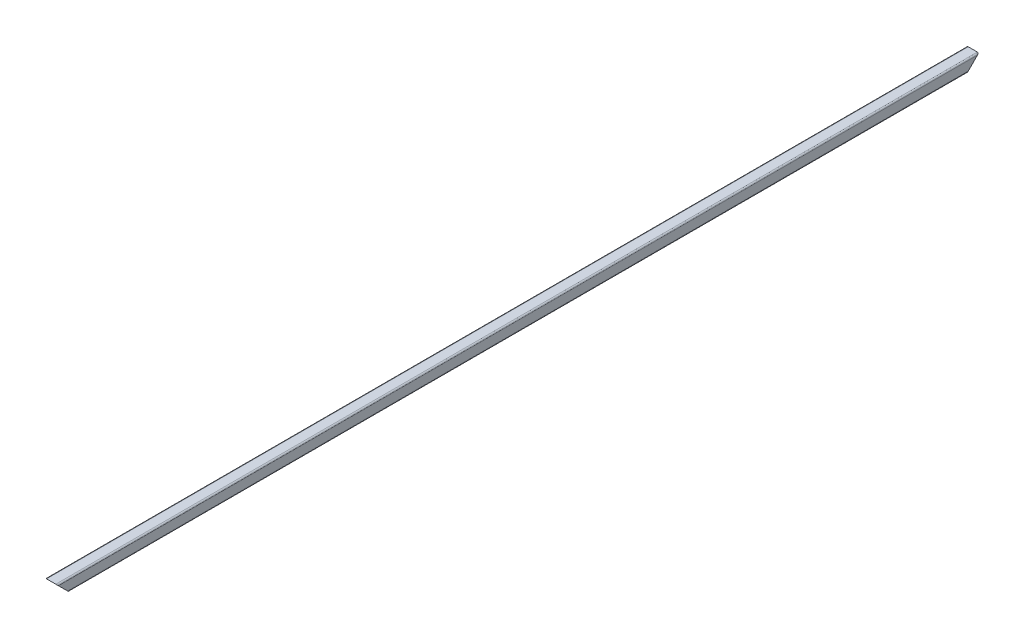
ISO-10303-21;
HEADER;
FILE_DESCRIPTION(('STEP AP214'),'2;1');
FILE_NAME('part.step','',(''),(''),'','','');
FILE_SCHEMA(('AUTOMOTIVE_DESIGN { 1 0 10303 214 1 1 1 1 }'));
ENDSEC;
DATA;
#1=APPLICATION_CONTEXT('core data for automotive mechanical design processes');
#2=APPLICATION_PROTOCOL_DEFINITION('international standard','automotive_design',2000,#1);
#3=PRODUCT_CONTEXT('',#1,'mechanical');
#4=PRODUCT('Part','Part','',(#3));
#5=PRODUCT_RELATED_PRODUCT_CATEGORY('part','',(#4));
#6=PRODUCT_DEFINITION_FORMATION('','',#4);
#7=PRODUCT_DEFINITION_CONTEXT('part definition',#1,'design');
#8=PRODUCT_DEFINITION('design','',#6,#7);
#9=PRODUCT_DEFINITION_SHAPE('','',#8);
#10=(LENGTH_UNIT() NAMED_UNIT(*) SI_UNIT(.MILLI.,.METRE.));
#11=(NAMED_UNIT(*) PLANE_ANGLE_UNIT() SI_UNIT($,.RADIAN.));
#12=(NAMED_UNIT(*) SI_UNIT($,.STERADIAN.) SOLID_ANGLE_UNIT());
#13=UNCERTAINTY_MEASURE_WITH_UNIT(LENGTH_MEASURE(1.E-05),#10,'distance_accuracy_value','');
#14=(GEOMETRIC_REPRESENTATION_CONTEXT(3) GLOBAL_UNCERTAINTY_ASSIGNED_CONTEXT((#13)) GLOBAL_UNIT_ASSIGNED_CONTEXT((#10,
#11,#12)) REPRESENTATION_CONTEXT('',''));
#15=CARTESIAN_POINT('',(0.,0.,0.));
#16=DIRECTION('',(0.,0.,1.));
#17=DIRECTION('',(1.,0.,0.));
#18=AXIS2_PLACEMENT_3D('',#15,#16,#17);
#19=CARTESIAN_POINT('',(-15.5000000000105,1940.,-3059.99999999996));
#20=DIRECTION('',(0.,1.,0.));
#21=DIRECTION('',(0.,0.,0.99999999999999));
#22=AXIS2_PLACEMENT_3D('',#19,#20,#21);
#23=PLANE('',#22);
#24=DIRECTION('',(1.,0.,0.));
#25=VECTOR('',#24,1.);
#26=CARTESIAN_POINT('',(-15.5000000000106,1940.00000000001,-19.9999999999911));
#27=LINE('',#26,#25);
#28=CARTESIAN_POINT('',(-15.5000000000106,1940.00000000001,-19.9999999999902));
#29=VERTEX_POINT('',#28);
#30=CARTESIAN_POINT('',(15.4999999999891,1940.,-19.9999999999929));
#31=VERTEX_POINT('',#30);
#32=EDGE_CURVE('E267',#29,#31,#27,.T.);
#33=ORIENTED_EDGE('',*,*,#32,.F.);
#34=DIRECTION('',(0.,0.,0.99999999999999));
#35=VECTOR('',#34,1.);
#36=CARTESIAN_POINT('',(-15.5000000000105,1940.,-3059.99999999996));
#37=LINE('',#36,#35);
#38=CARTESIAN_POINT('',(-15.5000000000057,1940.,-3039.99999999996));
#39=VERTEX_POINT('',#38);
#40=EDGE_CURVE('E231',#39,#29,#37,.T.);
#41=ORIENTED_EDGE('',*,*,#40,.F.);
#42=DIRECTION('',(-1.,0.,0.));
#43=VECTOR('',#42,1.);
#44=CARTESIAN_POINT('',(-15.5000000000057,1940.,-3039.99999999996));
#45=LINE('',#44,#43);
#46=CARTESIAN_POINT('',(15.4999999999945,1939.99999999999,-3039.99999999996));
#47=VERTEX_POINT('',#46);
#48=EDGE_CURVE('E331',#47,#39,#45,.T.);
#49=ORIENTED_EDGE('',*,*,#48,.F.);
#50=DIRECTION('',(0.,0.,0.99999999999999));
#51=VECTOR('',#50,1.);
#52=CARTESIAN_POINT('',(15.4999999999892,1940.,-3059.99999999996));
#53=LINE('',#52,#51);
#54=EDGE_CURVE('E234',#47,#31,#53,.T.);
#55=ORIENTED_EDGE('',*,*,#54,.T.);
#56=EDGE_LOOP('',(#33,#41,#49,#55));
#57=FACE_BOUND('',#56,.T.);
#58=ADVANCED_FACE('F45',(#57),#23,.F.);
#59=CARTESIAN_POINT('',(-20.0000000000107,1944.5,-3059.99999999996));
#60=DIRECTION('',(1.,0.,0.));
#61=DIRECTION('',(0.,0.,-0.99999999999999));
#62=AXIS2_PLACEMENT_3D('',#59,#60,#61);
#63=PLANE('',#62);
#64=DIRECTION('',(0.,-0.707106781186548,-0.707106781186537));
#65=VECTOR('',#64,1.);
#66=CARTESIAN_POINT('',(-20.0000000000107,422.25,-1537.74999999998));
#67=LINE('',#66,#65);
#68=CARTESIAN_POINT('',(-20.00000000001,1975.5,15.4999999999998));
#69=VERTEX_POINT('',#68);
#70=CARTESIAN_POINT('',(-20.0000000000053,1944.5,-15.4999999999959));
#71=VERTEX_POINT('',#70);
#72=EDGE_CURVE('E284',#69,#71,#67,.T.);
#73=ORIENTED_EDGE('',*,*,#72,.F.);
#74=DIRECTION('',(0.,0.,0.99999999999999));
#75=VECTOR('',#74,1.);
#76=CARTESIAN_POINT('',(-20.0000000000159,1975.5,-3059.99999999996));
#77=LINE('',#76,#75);
#78=CARTESIAN_POINT('',(-20.00000000001,1975.49999999999,-3075.49999999996));
#79=VERTEX_POINT('',#78);
#80=EDGE_CURVE('E203',#79,#69,#77,.T.);
#81=ORIENTED_EDGE('',*,*,#80,.F.);
#82=DIRECTION('',(0.,0.707106781186548,-0.707106781186537));
#83=VECTOR('',#82,1.);
#84=CARTESIAN_POINT('',(-20.0000000000052,1952.25,-3052.24999999996));
#85=LINE('',#84,#83);
#86=CARTESIAN_POINT('',(-20.0000000000107,1944.5,-3044.49999999996));
#87=VERTEX_POINT('',#86);
#88=EDGE_CURVE('E354',#87,#79,#85,.T.);
#89=ORIENTED_EDGE('',*,*,#88,.F.);
#90=DIRECTION('',(0.,0.,0.99999999999999));
#91=VECTOR('',#90,1.);
#92=CARTESIAN_POINT('',(-20.0000000000107,1944.5,-3059.99999999996));
#93=LINE('',#92,#91);
#94=EDGE_CURVE('E64',#87,#71,#93,.T.);
#95=ORIENTED_EDGE('',*,*,#94,.T.);
#96=EDGE_LOOP('',(#73,#81,#89,#95));
#97=FACE_BOUND('',#96,.T.);
#98=ADVANCED_FACE('F366',(#97),#63,.F.);
#99=CARTESIAN_POINT('',(-15.5000000000158,1975.5,-3059.99999999996));
#100=DIRECTION('',(0.,0.,0.99999999999999));
#101=DIRECTION('',(1.,0.,0.));
#102=AXIS2_PLACEMENT_3D('',#99,#100,#101);
#103=CYLINDRICAL_SURFACE('',#102,4.5);
#104=CARTESIAN_POINT('',(-15.5000000000105,1975.50000000001,15.5000000000021));
#105=DIRECTION('',(0.,-0.707106781186547,0.707106781186538));
#106=DIRECTION('',(0.,0.707106781186548,0.707106781186537));
#107=AXIS2_PLACEMENT_3D('',#104,#105,#106);
#108=ELLIPSE('',#107,6.36396103067893,4.5);
#109=CARTESIAN_POINT('',(-15.5000000000105,1980.,20.0000000000058));
#110=VERTEX_POINT('',#109);
#111=EDGE_CURVE('E288',#110,#69,#108,.T.);
#112=ORIENTED_EDGE('',*,*,#111,.F.);
#113=DIRECTION('',(0.,0.,0.99999999999999));
#114=VECTOR('',#113,1.);
#115=CARTESIAN_POINT('',(-15.5000000000105,1980.,-3059.99999999996));
#116=LINE('',#115,#114);
#117=CARTESIAN_POINT('',(-15.5000000000052,1980.00000000001,-3079.99999999996));
#118=VERTEX_POINT('',#117);
#119=EDGE_CURVE('E249',#118,#110,#116,.T.);
#120=ORIENTED_EDGE('',*,*,#119,.F.);
#121=CARTESIAN_POINT('',(-15.5000000000106,1975.5,-3075.49999999996));
#122=DIRECTION('',(0.,-0.707106781186547,-0.707106781186538));
#123=DIRECTION('',(0.,-0.707106781186548,0.707106781186537));
#124=AXIS2_PLACEMENT_3D('',#121,#122,#123);
#125=ELLIPSE('',#124,6.36396103067893,4.5);
#126=EDGE_CURVE('E351',#79,#118,#125,.T.);
#127=ORIENTED_EDGE('',*,*,#126,.F.);
#128=ORIENTED_EDGE('',*,*,#80,.T.);
#129=EDGE_LOOP('',(#112,#120,#127,#128));
#130=FACE_BOUND('',#129,.T.);
#131=ADVANCED_FACE('F368',(#130),#103,.T.);
#132=CARTESIAN_POINT('',(-15.5000000000105,1980.,-3059.99999999996));
#133=DIRECTION('',(0.,-1.,0.));
#134=DIRECTION('',(0.,0.,-0.99999999999999));
#135=AXIS2_PLACEMENT_3D('',#132,#133,#134);
#136=PLANE('',#135);
#137=DIRECTION('',(-1.,0.,0.));
#138=VECTOR('',#137,1.);
#139=CARTESIAN_POINT('',(-15.5000000000105,1980.,20.0000000000067));
#140=LINE('',#139,#138);
#141=CARTESIAN_POINT('',(15.4999999999892,1979.99999999999,19.9999999999974));
#142=VERTEX_POINT('',#141);
#143=EDGE_CURVE('E292',#142,#110,#140,.T.);
#144=ORIENTED_EDGE('',*,*,#143,.F.);
#145=DIRECTION('',(0.,0.,0.99999999999999));
#146=VECTOR('',#145,1.);
#147=CARTESIAN_POINT('',(15.4999999999896,1980.,-3059.99999999996));
#148=LINE('',#147,#146);
#149=CARTESIAN_POINT('',(15.4999999999945,1980.,-3079.99999999996));
#150=VERTEX_POINT('',#149);
#151=EDGE_CURVE('E245',#150,#142,#148,.T.);
#152=ORIENTED_EDGE('',*,*,#151,.F.);
#153=DIRECTION('',(1.,0.,0.));
#154=VECTOR('',#153,1.);
#155=CARTESIAN_POINT('',(-15.5000000000052,1980.00000000001,-3079.99999999996));
#156=LINE('',#155,#154);
#157=EDGE_CURVE('E347',#118,#150,#156,.T.);
#158=ORIENTED_EDGE('',*,*,#157,.F.);
#159=ORIENTED_EDGE('',*,*,#119,.T.);
#160=EDGE_LOOP('',(#144,#152,#158,#159));
#161=FACE_BOUND('',#160,.T.);
#162=ADVANCED_FACE('F372',(#161),#136,.F.);
#163=CARTESIAN_POINT('',(15.4999999999843,1975.5,-3059.99999999996));
#164=DIRECTION('',(0.,0.,0.99999999999999));
#165=DIRECTION('',(1.,0.,0.));
#166=AXIS2_PLACEMENT_3D('',#163,#164,#165);
#167=CYLINDRICAL_SURFACE('',#166,4.5);
#168=CARTESIAN_POINT('',(15.4999999999896,1975.5,15.5000000000061));
#169=DIRECTION('',(0.,-0.707106781186547,0.707106781186538));
#170=DIRECTION('',(0.,0.707106781186548,0.707106781186537));
#171=AXIS2_PLACEMENT_3D('',#168,#169,#170);
#172=ELLIPSE('',#171,6.36396103067893,4.5);
#173=CARTESIAN_POINT('',(19.9999999999896,1975.50000000001,15.5000000000061));
#174=VERTEX_POINT('',#173);
#175=EDGE_CURVE('E296',#174,#142,#172,.T.);
#176=ORIENTED_EDGE('',*,*,#175,.F.);
#177=DIRECTION('',(0.,0.,0.99999999999999));
#178=VECTOR('',#177,1.);
#179=CARTESIAN_POINT('',(19.9999999999841,1975.5,-3059.99999999996));
#180=LINE('',#179,#178);
#181=CARTESIAN_POINT('',(19.9999999999896,1975.5,-3075.49999999996));
#182=VERTEX_POINT('',#181);
#183=EDGE_CURVE('E241',#182,#174,#180,.T.);
#184=ORIENTED_EDGE('',*,*,#183,.F.);
#185=CARTESIAN_POINT('',(15.4999999999896,1975.49999999999,-3075.49999999996));
#186=DIRECTION('',(0.,-0.707106781186547,-0.707106781186538));
#187=DIRECTION('',(0.,-0.707106781186548,0.707106781186537));
#188=AXIS2_PLACEMENT_3D('',#185,#186,#187);
#189=ELLIPSE('',#188,6.36396103067893,4.5);
#190=EDGE_CURVE('E343',#150,#182,#189,.T.);
#191=ORIENTED_EDGE('',*,*,#190,.F.);
#192=ORIENTED_EDGE('',*,*,#151,.T.);
#193=EDGE_LOOP('',(#176,#184,#191,#192));
#194=FACE_BOUND('',#193,.T.);
#195=ADVANCED_FACE('F374',(#194),#167,.T.);
#196=CARTESIAN_POINT('',(19.9999999999894,1944.5,-3059.99999999996));
#197=DIRECTION('',(-1.,0.,0.));
#198=DIRECTION('',(0.,0.,0.99999999999999));
#199=AXIS2_PLACEMENT_3D('',#196,#197,#198);
#200=PLANE('',#199);
#201=DIRECTION('',(0.,0.707106781186548,0.707106781186537));
#202=VECTOR('',#201,1.);
#203=CARTESIAN_POINT('',(19.9999999999894,422.250000000006,-1537.74999999997));
#204=LINE('',#203,#202);
#205=CARTESIAN_POINT('',(19.9999999999947,1944.5,-15.5000000000001));
#206=VERTEX_POINT('',#205);
#207=EDGE_CURVE('E300',#206,#174,#204,.T.);
#208=ORIENTED_EDGE('',*,*,#207,.F.);
#209=DIRECTION('',(0.,0.,0.99999999999999));
#210=VECTOR('',#209,1.);
#211=CARTESIAN_POINT('',(19.9999999999894,1944.5,-3059.99999999996));
#212=LINE('',#211,#210);
#213=CARTESIAN_POINT('',(19.9999999999894,1944.5,-3044.49999999996));
#214=VERTEX_POINT('',#213);
#215=EDGE_CURVE('E237',#214,#206,#212,.T.);
#216=ORIENTED_EDGE('',*,*,#215,.F.);
#217=DIRECTION('',(0.,-0.707106781186548,0.707106781186537));
#218=VECTOR('',#217,1.);
#219=CARTESIAN_POINT('',(19.9999999999948,1952.25,-3052.24999999996));
#220=LINE('',#219,#218);
#221=EDGE_CURVE('E339',#182,#214,#220,.T.);
#222=ORIENTED_EDGE('',*,*,#221,.F.);
#223=ORIENTED_EDGE('',*,*,#183,.T.);
#224=EDGE_LOOP('',(#208,#216,#222,#223));
#225=FACE_BOUND('',#224,.T.);
#226=ADVANCED_FACE('F379',(#225),#200,.F.);
#227=CARTESIAN_POINT('',(15.4999999999896,1944.5,-3059.99999999996));
#228=DIRECTION('',(0.,0.,0.99999999999999));
#229=DIRECTION('',(1.,0.,0.));
#230=AXIS2_PLACEMENT_3D('',#227,#228,#229);
#231=CYLINDRICAL_SURFACE('',#230,4.5);
#232=CARTESIAN_POINT('',(15.4999999999949,1944.5,-15.5000000000025));
#233=DIRECTION('',(0.,-0.707106781186547,0.707106781186538));
#234=DIRECTION('',(0.,0.707106781186548,0.707106781186537));
#235=AXIS2_PLACEMENT_3D('',#232,#233,#234);
#236=ELLIPSE('',#235,6.36396103067893,4.5);
#237=EDGE_CURVE('E304',#31,#206,#236,.T.);
#238=ORIENTED_EDGE('',*,*,#237,.F.);
#239=ORIENTED_EDGE('',*,*,#54,.F.);
#240=CARTESIAN_POINT('',(15.4999999999891,1944.5,-3044.49999999996));
#241=DIRECTION('',(0.,-0.707106781186547,-0.707106781186538));
#242=DIRECTION('',(0.,-0.707106781186548,0.707106781186537));
#243=AXIS2_PLACEMENT_3D('',#240,#241,#242);
#244=ELLIPSE('',#243,6.36396103067893,4.5);
#245=EDGE_CURVE('E335',#214,#47,#244,.T.);
#246=ORIENTED_EDGE('',*,*,#245,.F.);
#247=ORIENTED_EDGE('',*,*,#215,.T.);
#248=EDGE_LOOP('',(#238,#239,#246,#247));
#249=FACE_BOUND('',#248,.T.);
#250=ADVANCED_FACE('F381',(#249),#231,.T.);
#251=CARTESIAN_POINT('',(-15.5000000000105,1944.5,-3059.99999999996));
#252=DIRECTION('',(0.,0.,0.99999999999999));
#253=DIRECTION('',(1.,0.,0.));
#254=AXIS2_PLACEMENT_3D('',#251,#252,#253);
#255=CYLINDRICAL_SURFACE('',#254,4.5);
#256=CARTESIAN_POINT('',(-15.5000000000052,1944.5,-15.4999999999932));
#257=DIRECTION('',(0.,-0.707106781186547,0.707106781186538));
#258=DIRECTION('',(0.,0.707106781186548,0.707106781186537));
#259=AXIS2_PLACEMENT_3D('',#256,#257,#258);
#260=ELLIPSE('',#259,6.36396103067893,4.5);
#261=EDGE_CURVE('E189',#71,#29,#260,.T.);
#262=ORIENTED_EDGE('',*,*,#261,.F.);
#263=ORIENTED_EDGE('',*,*,#94,.F.);
#264=CARTESIAN_POINT('',(-15.5000000000106,1944.5,-3044.49999999996));
#265=DIRECTION('',(0.,-0.707106781186547,-0.707106781186538));
#266=DIRECTION('',(0.,-0.707106781186548,0.707106781186537));
#267=AXIS2_PLACEMENT_3D('',#264,#265,#266);
#268=ELLIPSE('',#267,6.36396103067893,4.5);
#269=EDGE_CURVE('E206',#39,#87,#268,.T.);
#270=ORIENTED_EDGE('',*,*,#269,.F.);
#271=ORIENTED_EDGE('',*,*,#40,.T.);
#272=EDGE_LOOP('',(#262,#263,#270,#271));
#273=FACE_BOUND('',#272,.T.);
#274=ADVANCED_FACE('F47',(#273),#255,.T.);
#275=CARTESIAN_POINT('',(-15.0000000000107,1945.,-3059.99999999996));
#276=DIRECTION('',(0.,0.,0.99999999999999));
#277=DIRECTION('',(1.,0.,0.));
#278=AXIS2_PLACEMENT_3D('',#275,#276,#277);
#279=CYLINDRICAL_SURFACE('',#278,3.);
#280=DIRECTION('',(0.,0.,0.99999999999999));
#281=VECTOR('',#280,1.);
#282=CARTESIAN_POINT('',(-18.0000000000105,1945.,-3059.99999999996));
#283=LINE('',#282,#281);
#284=CARTESIAN_POINT('',(-18.0000000000103,1945.,-3044.99999999996));
#285=VERTEX_POINT('',#284);
#286=CARTESIAN_POINT('',(-18.0000000000006,1944.99999999999,-15.0000000000021));
#287=VERTEX_POINT('',#286);
#288=EDGE_CURVE('E184',#285,#287,#283,.T.);
#289=ORIENTED_EDGE('',*,*,#288,.T.);
#290=CARTESIAN_POINT('',(-15.0000000000001,1945.,-14.999999999997));
#291=DIRECTION('',(0.,-0.707106781186547,0.707106781186538));
#292=DIRECTION('',(0.,0.707106781186548,0.707106781186537));
#293=AXIS2_PLACEMENT_3D('',#290,#291,#292);
#294=ELLIPSE('',#293,4.24264068711928,3.);
#295=CARTESIAN_POINT('',(-15.0000000000001,1942.,-17.9999999999976));
#296=VERTEX_POINT('',#295);
#297=EDGE_CURVE('E11',#287,#296,#294,.T.);
#298=ORIENTED_EDGE('',*,*,#297,.T.);
#299=DIRECTION('',(0.,0.,0.99999999999999));
#300=VECTOR('',#299,1.);
#301=CARTESIAN_POINT('',(-15.0000000000108,1942.,-3059.99999999996));
#302=LINE('',#301,#300);
#303=CARTESIAN_POINT('',(-15.0000000000108,1942.00000000001,-3041.99999999996));
#304=VERTEX_POINT('',#303);
#305=EDGE_CURVE('E228',#304,#296,#302,.T.);
#306=ORIENTED_EDGE('',*,*,#305,.F.);
#307=CARTESIAN_POINT('',(-15.0000000000107,1945.00000000001,-3044.99999999996));
#308=DIRECTION('',(0.,-0.707106781186547,-0.707106781186538));
#309=DIRECTION('',(0.,-0.707106781186548,0.707106781186537));
#310=AXIS2_PLACEMENT_3D('',#307,#308,#309);
#311=ELLIPSE('',#310,4.24264068711928,3.);
#312=EDGE_CURVE('E194',#304,#285,#311,.T.);
#313=ORIENTED_EDGE('',*,*,#312,.T.);
#314=EDGE_LOOP('',(#289,#298,#306,#313));
#315=FACE_BOUND('',#314,.T.);
#316=ADVANCED_FACE('F193',(#315),#279,.F.);
#317=CARTESIAN_POINT('',(-15.0000000000108,1942.,-3059.99999999996));
#318=DIRECTION('',(0.,1.,0.));
#319=DIRECTION('',(0.,0.,0.99999999999999));
#320=AXIS2_PLACEMENT_3D('',#317,#318,#319);
#321=PLANE('',#320);
#322=ORIENTED_EDGE('',*,*,#305,.T.);
#323=DIRECTION('',(1.,0.,0.));
#324=VECTOR('',#323,1.);
#325=CARTESIAN_POINT('',(-15.0000000000001,1942.,-17.9999999999976));
#326=LINE('',#325,#324);
#327=CARTESIAN_POINT('',(14.9999999999997,1941.99999999999,-18.0000000000027));
#328=VERTEX_POINT('',#327);
#329=EDGE_CURVE('E73',#296,#328,#326,.T.);
#330=ORIENTED_EDGE('',*,*,#329,.T.);
#331=DIRECTION('',(0.,0.,0.99999999999999));
#332=VECTOR('',#331,1.);
#333=CARTESIAN_POINT('',(14.9999999999895,1942.,-3059.99999999996));
#334=LINE('',#333,#332);
#335=CARTESIAN_POINT('',(14.9999999999895,1942.,-3041.99999999996));
#336=VERTEX_POINT('',#335);
#337=EDGE_CURVE('E224',#336,#328,#334,.T.);
#338=ORIENTED_EDGE('',*,*,#337,.F.);
#339=DIRECTION('',(-1.,0.,0.));
#340=VECTOR('',#339,1.);
#341=CARTESIAN_POINT('',(-15.0000000000108,1942.00000000001,-3041.99999999996));
#342=LINE('',#341,#340);
#343=EDGE_CURVE('E325',#336,#304,#342,.T.);
#344=ORIENTED_EDGE('',*,*,#343,.T.);
#345=EDGE_LOOP('',(#322,#330,#338,#344));
#346=FACE_BOUND('',#345,.T.);
#347=ADVANCED_FACE('F418',(#346),#321,.T.);
#348=CARTESIAN_POINT('',(14.9999999999895,1945.,-3059.99999999996));
#349=DIRECTION('',(0.,0.,0.99999999999999));
#350=DIRECTION('',(1.,0.,0.));
#351=AXIS2_PLACEMENT_3D('',#348,#349,#350);
#352=CYLINDRICAL_SURFACE('',#351,3.);
#353=ORIENTED_EDGE('',*,*,#337,.T.);
#354=CARTESIAN_POINT('',(14.9999999999997,1944.99999999999,-15.0000000000023));
#355=DIRECTION('',(0.,-0.707106781186547,0.707106781186538));
#356=DIRECTION('',(0.,0.707106781186548,0.707106781186537));
#357=AXIS2_PLACEMENT_3D('',#354,#355,#356);
#358=ELLIPSE('',#357,4.24264068711928,3.);
#359=CARTESIAN_POINT('',(17.9999999999999,1945.,-14.999999999997));
#360=VERTEX_POINT('',#359);
#361=EDGE_CURVE('E503',#328,#360,#358,.T.);
#362=ORIENTED_EDGE('',*,*,#361,.T.);
#363=DIRECTION('',(0.,0.,0.99999999999999));
#364=VECTOR('',#363,1.);
#365=CARTESIAN_POINT('',(17.9999999999896,1945.,-3059.99999999996));
#366=LINE('',#365,#364);
#367=CARTESIAN_POINT('',(17.9999999999892,1945.00000000001,-3044.99999999996));
#368=VERTEX_POINT('',#367);
#369=EDGE_CURVE('E220',#368,#360,#366,.T.);
#370=ORIENTED_EDGE('',*,*,#369,.F.);
#371=CARTESIAN_POINT('',(14.9999999999895,1945.,-3044.99999999996));
#372=DIRECTION('',(0.,-0.707106781186547,-0.707106781186538));
#373=DIRECTION('',(0.,-0.707106781186548,0.707106781186537));
#374=AXIS2_PLACEMENT_3D('',#371,#372,#373);
#375=ELLIPSE('',#374,4.24264068711928,3.);
#376=EDGE_CURVE('E321',#368,#336,#375,.T.);
#377=ORIENTED_EDGE('',*,*,#376,.T.);
#378=EDGE_LOOP('',(#353,#362,#370,#377));
#379=FACE_BOUND('',#378,.T.);
#380=ADVANCED_FACE('F414',(#379),#352,.F.);
#381=CARTESIAN_POINT('',(17.9999999999896,1945.,-3059.99999999996));
#382=DIRECTION('',(-1.,0.,0.));
#383=DIRECTION('',(0.,0.,0.99999999999999));
#384=AXIS2_PLACEMENT_3D('',#381,#382,#383);
#385=PLANE('',#384);
#386=ORIENTED_EDGE('',*,*,#369,.T.);
#387=DIRECTION('',(0.,0.707106781186548,0.707106781186537));
#388=VECTOR('',#387,1.);
#389=CARTESIAN_POINT('',(17.9999999999898,422.5,-1537.49999999998));
#390=LINE('',#389,#388);
#391=CARTESIAN_POINT('',(17.9999999999897,1975.00000000001,15.0000000000021));
#392=VERTEX_POINT('',#391);
#393=EDGE_CURVE('E505',#360,#392,#390,.T.);
#394=ORIENTED_EDGE('',*,*,#393,.T.);
#395=DIRECTION('',(0.,0.,0.99999999999999));
#396=VECTOR('',#395,1.);
#397=CARTESIAN_POINT('',(17.9999999999844,1975.,-3059.99999999996));
#398=LINE('',#397,#396);
#399=CARTESIAN_POINT('',(17.9999999999946,1975.00000000001,-3074.99999999996));
#400=VERTEX_POINT('',#399);
#401=EDGE_CURVE('E216',#400,#392,#398,.T.);
#402=ORIENTED_EDGE('',*,*,#401,.F.);
#403=DIRECTION('',(0.,-0.707106781186548,0.707106781186537));
#404=VECTOR('',#403,1.);
#405=CARTESIAN_POINT('',(17.9999999999945,1952.5,-3052.49999999996));
#406=LINE('',#405,#404);
#407=EDGE_CURVE('E317',#400,#368,#406,.T.);
#408=ORIENTED_EDGE('',*,*,#407,.T.);
#409=EDGE_LOOP('',(#386,#394,#402,#408));
#410=FACE_BOUND('',#409,.T.);
#411=ADVANCED_FACE('F410',(#410),#385,.T.);
#412=CARTESIAN_POINT('',(14.9999999999841,1975.,-3059.99999999996));
#413=DIRECTION('',(0.,0.,0.99999999999999));
#414=DIRECTION('',(1.,0.,0.));
#415=AXIS2_PLACEMENT_3D('',#412,#413,#414);
#416=CYLINDRICAL_SURFACE('',#415,3.);
#417=ORIENTED_EDGE('',*,*,#401,.T.);
#418=CARTESIAN_POINT('',(14.9999999999895,1975.,14.9999999999966));
#419=DIRECTION('',(0.,-0.707106781186547,0.707106781186538));
#420=DIRECTION('',(0.,0.707106781186548,0.707106781186537));
#421=AXIS2_PLACEMENT_3D('',#418,#419,#420);
#422=ELLIPSE('',#421,4.24264068711928,3.);
#423=CARTESIAN_POINT('',(14.9999999999895,1978.,17.9999999999971));
#424=VERTEX_POINT('',#423);
#425=EDGE_CURVE('E277',#392,#424,#422,.T.);
#426=ORIENTED_EDGE('',*,*,#425,.T.);
#427=DIRECTION('',(0.,0.,0.99999999999999));
#428=VECTOR('',#427,1.);
#429=CARTESIAN_POINT('',(14.9999999999841,1978.,-3059.99999999996));
#430=LINE('',#429,#428);
#431=CARTESIAN_POINT('',(14.9999999999944,1978.,-3077.99999999996));
#432=VERTEX_POINT('',#431);
#433=EDGE_CURVE('E212',#432,#424,#430,.T.);
#434=ORIENTED_EDGE('',*,*,#433,.F.);
#435=CARTESIAN_POINT('',(14.9999999999943,1975.,-3074.99999999996));
#436=DIRECTION('',(0.,-0.707106781186547,-0.707106781186538));
#437=DIRECTION('',(0.,-0.707106781186548,0.707106781186537));
#438=AXIS2_PLACEMENT_3D('',#435,#436,#437);
#439=ELLIPSE('',#438,4.24264068711928,3.);
#440=EDGE_CURVE('E313',#432,#400,#439,.T.);
#441=ORIENTED_EDGE('',*,*,#440,.T.);
#442=EDGE_LOOP('',(#417,#426,#434,#441));
#443=FACE_BOUND('',#442,.T.);
#444=ADVANCED_FACE('F406',(#443),#416,.F.);
#445=CARTESIAN_POINT('',(-15.0000000000157,1978.,-3059.99999999996));
#446=DIRECTION('',(0.,-1.,0.));
#447=DIRECTION('',(0.,0.,-0.99999999999999));
#448=AXIS2_PLACEMENT_3D('',#445,#446,#447);
#449=PLANE('',#448);
#450=ORIENTED_EDGE('',*,*,#433,.T.);
#451=DIRECTION('',(-1.,0.,0.));
#452=VECTOR('',#451,1.);
#453=CARTESIAN_POINT('',(-15.0000000000103,1978.00000000001,18.0000000000022));
#454=LINE('',#453,#452);
#455=CARTESIAN_POINT('',(-15.0000000000103,1978.00000000001,18.0000000000022));
#456=VERTEX_POINT('',#455);
#457=EDGE_CURVE('E272',#424,#456,#454,.T.);
#458=ORIENTED_EDGE('',*,*,#457,.T.);
#459=DIRECTION('',(0.,0.,0.99999999999999));
#460=VECTOR('',#459,1.);
#461=CARTESIAN_POINT('',(-15.0000000000157,1978.,-3059.99999999996));
#462=LINE('',#461,#460);
#463=CARTESIAN_POINT('',(-15.0000000000055,1978.00000000001,-3077.99999999996));
#464=VERTEX_POINT('',#463);
#465=EDGE_CURVE('E201',#464,#456,#462,.T.);
#466=ORIENTED_EDGE('',*,*,#465,.F.);
#467=DIRECTION('',(1.,0.,0.));
#468=VECTOR('',#467,1.);
#469=CARTESIAN_POINT('',(-15.0000000000055,1978.00000000001,-3077.99999999996));
#470=LINE('',#469,#468);
#471=EDGE_CURVE('E263',#464,#432,#470,.T.);
#472=ORIENTED_EDGE('',*,*,#471,.T.);
#473=EDGE_LOOP('',(#450,#458,#466,#472));
#474=FACE_BOUND('',#473,.T.);
#475=ADVANCED_FACE('F403',(#474),#449,.T.);
#476=CARTESIAN_POINT('',(-15.0000000000157,1975.,-3059.99999999996));
#477=DIRECTION('',(0.,0.,0.99999999999999));
#478=DIRECTION('',(1.,0.,0.));
#479=AXIS2_PLACEMENT_3D('',#476,#477,#478);
#480=CYLINDRICAL_SURFACE('',#479,3.);
#481=ORIENTED_EDGE('',*,*,#465,.T.);
#482=CARTESIAN_POINT('',(-15.0000000000103,1975.00000000001,15.0000000000019));
#483=DIRECTION('',(0.,-0.707106781186547,0.707106781186538));
#484=DIRECTION('',(0.,0.707106781186548,0.707106781186537));
#485=AXIS2_PLACEMENT_3D('',#482,#483,#484);
#486=ELLIPSE('',#485,4.24264068711928,3.);
#487=CARTESIAN_POINT('',(-18.0000000000103,1975.,14.9999999999966));
#488=VERTEX_POINT('',#487);
#489=EDGE_CURVE('E190',#456,#488,#486,.T.);
#490=ORIENTED_EDGE('',*,*,#489,.T.);
#491=DIRECTION('',(0.,0.,0.99999999999999));
#492=VECTOR('',#491,1.);
#493=CARTESIAN_POINT('',(-18.0000000000157,1975.,-3059.99999999996));
#494=LINE('',#493,#492);
#495=CARTESIAN_POINT('',(-18.0000000000055,1975.,-3074.99999999996));
#496=VERTEX_POINT('',#495);
#497=EDGE_CURVE('E186',#496,#488,#494,.T.);
#498=ORIENTED_EDGE('',*,*,#497,.F.);
#499=CARTESIAN_POINT('',(-15.0000000000055,1975.00000000001,-3074.99999999996));
#500=DIRECTION('',(0.,-0.707106781186547,-0.707106781186538));
#501=DIRECTION('',(0.,-0.707106781186548,0.707106781186537));
#502=AXIS2_PLACEMENT_3D('',#499,#500,#501);
#503=ELLIPSE('',#502,4.24264068711928,3.);
#504=EDGE_CURVE('E261',#496,#464,#503,.T.);
#505=ORIENTED_EDGE('',*,*,#504,.T.);
#506=EDGE_LOOP('',(#481,#490,#498,#505));
#507=FACE_BOUND('',#506,.T.);
#508=ADVANCED_FACE('F269',(#507),#480,.F.);
#509=CARTESIAN_POINT('',(-18.0000000000105,1945.,-3059.99999999996));
#510=DIRECTION('',(1.,0.,0.));
#511=DIRECTION('',(0.,0.,-0.99999999999999));
#512=AXIS2_PLACEMENT_3D('',#509,#510,#511);
#513=PLANE('',#512);
#514=ORIENTED_EDGE('',*,*,#497,.T.);
#515=DIRECTION('',(0.,-0.707106781186548,-0.707106781186537));
#516=VECTOR('',#515,1.);
#517=CARTESIAN_POINT('',(-18.0000000000102,422.5,-1537.49999999998));
#518=LINE('',#517,#516);
#519=EDGE_CURVE('E175',#488,#287,#518,.T.);
#520=ORIENTED_EDGE('',*,*,#519,.T.);
#521=ORIENTED_EDGE('',*,*,#288,.F.);
#522=DIRECTION('',(0.,0.707106781186548,-0.707106781186537));
#523=VECTOR('',#522,1.);
#524=CARTESIAN_POINT('',(-18.0000000000056,1952.5,-3052.49999999996));
#525=LINE('',#524,#523);
#526=EDGE_CURVE('E54',#285,#496,#525,.T.);
#527=ORIENTED_EDGE('',*,*,#526,.T.);
#528=EDGE_LOOP('',(#514,#520,#521,#527));
#529=FACE_BOUND('',#528,.T.);
#530=ADVANCED_FACE('F182',(#529),#513,.T.);
#531=CARTESIAN_POINT('',(-5.32907051985511E-12,1960.,6.66133814775094E-12));
#532=DIRECTION('',(0.,-0.707106781186547,0.707106781186538));
#533=DIRECTION('',(0.,-0.707106781186548,-0.707106781186537));
#534=AXIS2_PLACEMENT_3D('',#531,#532,#533);
#535=PLANE('',#534);
#536=ORIENTED_EDGE('',*,*,#519,.F.);
#537=ORIENTED_EDGE('',*,*,#489,.F.);
#538=ORIENTED_EDGE('',*,*,#457,.F.);
#539=ORIENTED_EDGE('',*,*,#425,.F.);
#540=ORIENTED_EDGE('',*,*,#393,.F.);
#541=ORIENTED_EDGE('',*,*,#361,.F.);
#542=ORIENTED_EDGE('',*,*,#329,.F.);
#543=ORIENTED_EDGE('',*,*,#297,.F.);
#544=EDGE_LOOP('',(#536,#537,#538,#539,#540,#541,#542,#543));
#545=FACE_BOUND('',#544,.T.);
#546=ORIENTED_EDGE('',*,*,#261,.T.);
#547=ORIENTED_EDGE('',*,*,#32,.T.);
#548=ORIENTED_EDGE('',*,*,#237,.T.);
#549=ORIENTED_EDGE('',*,*,#207,.T.);
#550=ORIENTED_EDGE('',*,*,#175,.T.);
#551=ORIENTED_EDGE('',*,*,#143,.T.);
#552=ORIENTED_EDGE('',*,*,#111,.T.);
#553=ORIENTED_EDGE('',*,*,#72,.T.);
#554=EDGE_LOOP('',(#546,#547,#548,#549,#550,#551,#552,#553));
#555=FACE_BOUND('',#554,.T.);
#556=ADVANCED_FACE('F173',(#545,#555),#535,.T.);
#557=CARTESIAN_POINT('',(-1.06581409906998E-11,1960.,-3059.99999999996));
#558=DIRECTION('',(0.,-0.707106781186547,-0.707106781186538));
#559=DIRECTION('',(0.,0.707106781186548,-0.707106781186537));
#560=AXIS2_PLACEMENT_3D('',#557,#558,#559);
#561=PLANE('',#560);
#562=ORIENTED_EDGE('',*,*,#312,.F.);
#563=ORIENTED_EDGE('',*,*,#343,.F.);
#564=ORIENTED_EDGE('',*,*,#376,.F.);
#565=ORIENTED_EDGE('',*,*,#407,.F.);
#566=ORIENTED_EDGE('',*,*,#440,.F.);
#567=ORIENTED_EDGE('',*,*,#471,.F.);
#568=ORIENTED_EDGE('',*,*,#504,.F.);
#569=ORIENTED_EDGE('',*,*,#526,.F.);
#570=EDGE_LOOP('',(#562,#563,#564,#565,#566,#567,#568,#569));
#571=FACE_BOUND('',#570,.T.);
#572=ORIENTED_EDGE('',*,*,#48,.T.);
#573=ORIENTED_EDGE('',*,*,#269,.T.);
#574=ORIENTED_EDGE('',*,*,#88,.T.);
#575=ORIENTED_EDGE('',*,*,#126,.T.);
#576=ORIENTED_EDGE('',*,*,#157,.T.);
#577=ORIENTED_EDGE('',*,*,#190,.T.);
#578=ORIENTED_EDGE('',*,*,#221,.T.);
#579=ORIENTED_EDGE('',*,*,#245,.T.);
#580=EDGE_LOOP('',(#572,#573,#574,#575,#576,#577,#578,#579));
#581=FACE_BOUND('',#580,.T.);
#582=ADVANCED_FACE('F258',(#571,#581),#561,.T.);
#583=CLOSED_SHELL('',(#58,#98,#131,#162,#195,#226,#250,#274,#316,#347,#380,#411,#444,#475,#508,
#530,#556,#582));
#584=MANIFOLD_SOLID_BREP('B2',#583);
#585=ADVANCED_BREP_SHAPE_REPRESENTATION('',(#18,#584),#14);
#586=SHAPE_DEFINITION_REPRESENTATION(#9,#585);
ENDSEC;
END-ISO-10303-21;
